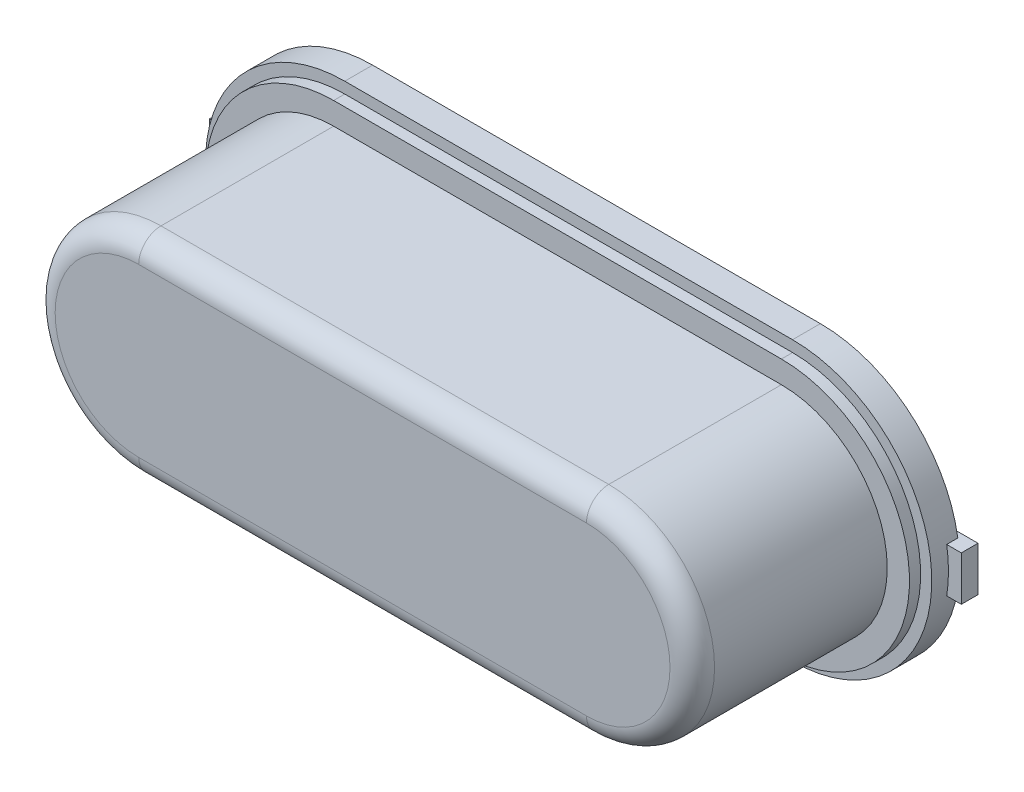
ISO-10303-21;
HEADER;
FILE_DESCRIPTION(('STEP AP214'),'2;1');
FILE_NAME('part.step','',(''),(''),'','','');
FILE_SCHEMA(('AUTOMOTIVE_DESIGN { 1 0 10303 214 1 1 1 1 }'));
ENDSEC;
DATA;
#1=APPLICATION_CONTEXT('core data for automotive mechanical design processes');
#2=APPLICATION_PROTOCOL_DEFINITION('international standard','automotive_design',2000,#1);
#3=PRODUCT_CONTEXT('',#1,'mechanical');
#4=PRODUCT('Part','Part','',(#3));
#5=PRODUCT_RELATED_PRODUCT_CATEGORY('part','',(#4));
#6=PRODUCT_DEFINITION_FORMATION('','',#4);
#7=PRODUCT_DEFINITION_CONTEXT('part definition',#1,'design');
#8=PRODUCT_DEFINITION('design','',#6,#7);
#9=PRODUCT_DEFINITION_SHAPE('','',#8);
#10=(LENGTH_UNIT() NAMED_UNIT(*) SI_UNIT(.MILLI.,.METRE.));
#11=(NAMED_UNIT(*) PLANE_ANGLE_UNIT() SI_UNIT($,.RADIAN.));
#12=(NAMED_UNIT(*) SI_UNIT($,.STERADIAN.) SOLID_ANGLE_UNIT());
#13=UNCERTAINTY_MEASURE_WITH_UNIT(LENGTH_MEASURE(1.E-05),#10,'distance_accuracy_value','');
#14=(GEOMETRIC_REPRESENTATION_CONTEXT(3) GLOBAL_UNCERTAINTY_ASSIGNED_CONTEXT((#13)) GLOBAL_UNIT_ASSIGNED_CONTEXT((#10,
#11,#12)) REPRESENTATION_CONTEXT('',''));
#15=CARTESIAN_POINT('',(0.,0.,0.));
#16=DIRECTION('',(0.,0.,1.));
#17=DIRECTION('',(1.,0.,0.));
#18=AXIS2_PLACEMENT_3D('',#15,#16,#17);
#19=CARTESIAN_POINT('',(0.,0.,0.1));
#20=DIRECTION('',(0.,0.,1.));
#21=DIRECTION('',(1.,0.,0.));
#22=AXIS2_PLACEMENT_3D('',#19,#20,#21);
#23=PLANE('',#22);
#24=DIRECTION('',(-1.,0.,0.));
#25=VECTOR('',#24,1.);
#26=CARTESIAN_POINT('',(0.,-0.4,0.1));
#27=LINE('',#26,#25);
#28=CARTESIAN_POINT('',(6.48774720177993,-0.399999999999998,0.1));
#29=VERTEX_POINT('',#28);
#30=CARTESIAN_POINT('',(2.2,-0.399999999999999,0.1));
#31=VERTEX_POINT('',#30);
#32=EDGE_CURVE('E250',#29,#31,#27,.T.);
#33=ORIENTED_EDGE('',*,*,#32,.F.);
#34=CARTESIAN_POINT('',(4.01995466592931,0.,0.1));
#35=DIRECTION('',(0.,0.,1.));
#36=DIRECTION('',(1.,0.,0.));
#37=AXIS2_PLACEMENT_3D('',#34,#35,#36);
#38=CIRCLE('',#37,2.5);
#39=CARTESIAN_POINT('',(4.01995466592932,-2.5,0.1));
#40=VERTEX_POINT('',#39);
#41=EDGE_CURVE('E290',#40,#29,#38,.T.);
#42=ORIENTED_EDGE('',*,*,#41,.F.);
#43=DIRECTION('',(1.,0.,0.));
#44=VECTOR('',#43,1.);
#45=CARTESIAN_POINT('',(-4.01995466592931,-2.5,0.1));
#46=LINE('',#45,#44);
#47=CARTESIAN_POINT('',(-4.01995466592931,-2.5,0.100000000000002));
#48=VERTEX_POINT('',#47);
#49=EDGE_CURVE('E286',#48,#40,#46,.T.);
#50=ORIENTED_EDGE('',*,*,#49,.F.);
#51=CARTESIAN_POINT('',(-4.01995466592931,0.,0.1));
#52=DIRECTION('',(0.,0.,1.));
#53=DIRECTION('',(1.,0.,0.));
#54=AXIS2_PLACEMENT_3D('',#51,#52,#53);
#55=CIRCLE('',#54,2.5);
#56=CARTESIAN_POINT('',(-6.48774720177993,-0.4,0.1));
#57=VERTEX_POINT('',#56);
#58=EDGE_CURVE('E393',#57,#48,#55,.T.);
#59=ORIENTED_EDGE('',*,*,#58,.F.);
#60=DIRECTION('',(-1.,0.,0.));
#61=VECTOR('',#60,1.);
#62=CARTESIAN_POINT('',(0.,-0.4,0.1));
#63=LINE('',#62,#61);
#64=CARTESIAN_POINT('',(-2.2,-0.4,0.1));
#65=VERTEX_POINT('',#64);
#66=EDGE_CURVE('E403',#65,#57,#63,.T.);
#67=ORIENTED_EDGE('',*,*,#66,.F.);
#68=DIRECTION('',(0.,-1.,0.));
#69=VECTOR('',#68,1.);
#70=CARTESIAN_POINT('',(-2.2,0.,0.1));
#71=LINE('',#70,#69);
#72=CARTESIAN_POINT('',(-2.2,0.4,0.1));
#73=VERTEX_POINT('',#72);
#74=EDGE_CURVE('E400',#73,#65,#71,.T.);
#75=ORIENTED_EDGE('',*,*,#74,.F.);
#76=DIRECTION('',(1.,0.,0.));
#77=VECTOR('',#76,1.);
#78=CARTESIAN_POINT('',(0.,0.4,0.1));
#79=LINE('',#78,#77);
#80=CARTESIAN_POINT('',(-6.48774720177993,0.4,0.1));
#81=VERTEX_POINT('',#80);
#82=EDGE_CURVE('E397',#81,#73,#79,.T.);
#83=ORIENTED_EDGE('',*,*,#82,.F.);
#84=CARTESIAN_POINT('',(-4.01995466592931,2.5,0.1));
#85=VERTEX_POINT('',#84);
#86=EDGE_CURVE('E394',#85,#81,#55,.T.);
#87=ORIENTED_EDGE('',*,*,#86,.F.);
#88=DIRECTION('',(-1.,0.,0.));
#89=VECTOR('',#88,1.);
#90=CARTESIAN_POINT('',(-4.01995466592931,2.5,0.1));
#91=LINE('',#90,#89);
#92=CARTESIAN_POINT('',(4.01995466592931,2.5,0.1));
#93=VERTEX_POINT('',#92);
#94=EDGE_CURVE('E293',#93,#85,#91,.T.);
#95=ORIENTED_EDGE('',*,*,#94,.F.);
#96=CARTESIAN_POINT('',(6.48774720177993,0.400000000000002,0.1));
#97=VERTEX_POINT('',#96);
#98=EDGE_CURVE('E289',#97,#93,#38,.T.);
#99=ORIENTED_EDGE('',*,*,#98,.F.);
#100=DIRECTION('',(1.,0.,0.));
#101=VECTOR('',#100,1.);
#102=CARTESIAN_POINT('',(0.,0.4,0.1));
#103=LINE('',#102,#101);
#104=CARTESIAN_POINT('',(2.2,0.400000000000001,0.1));
#105=VERTEX_POINT('',#104);
#106=EDGE_CURVE('E248',#105,#97,#103,.T.);
#107=ORIENTED_EDGE('',*,*,#106,.F.);
#108=DIRECTION('',(0.,1.,0.));
#109=VECTOR('',#108,1.);
#110=CARTESIAN_POINT('',(2.2,0.,0.1));
#111=LINE('',#110,#109);
#112=EDGE_CURVE('E12',#31,#105,#111,.T.);
#113=ORIENTED_EDGE('',*,*,#112,.F.);
#114=EDGE_LOOP('',(#33,#42,#50,#59,#67,#75,#83,#87,#95,#99,#107,#113));
#115=FACE_BOUND('',#114,.T.);
#116=ADVANCED_FACE('F39',(#115),#23,.F.);
#117=CARTESIAN_POINT('',(4.01995466592931,0.,4.3));
#118=DIRECTION('',(0.,0.,-1.));
#119=DIRECTION('',(-1.,0.,0.));
#120=AXIS2_PLACEMENT_3D('',#117,#118,#119);
#121=CYLINDRICAL_SURFACE('',#120,2.5);
#122=DIRECTION('',(0.,0.,-1.));
#123=VECTOR('',#122,1.);
#124=CARTESIAN_POINT('',(6.48774720177993,-0.399999999999998,4.3));
#125=LINE('',#124,#123);
#126=CARTESIAN_POINT('',(6.48774720177993,-0.399999999999998,0.3));
#127=VERTEX_POINT('',#126);
#128=EDGE_CURVE('E47',#127,#29,#125,.T.);
#129=ORIENTED_EDGE('',*,*,#128,.F.);
#130=CARTESIAN_POINT('',(4.01995466592931,0.,0.3));
#131=DIRECTION('',(0.,0.,1.));
#132=DIRECTION('',(1.,0.,0.));
#133=AXIS2_PLACEMENT_3D('',#130,#131,#132);
#134=CIRCLE('',#133,2.5);
#135=CARTESIAN_POINT('',(6.48774720177993,0.400000000000002,0.3));
#136=VERTEX_POINT('',#135);
#137=EDGE_CURVE('E216',#127,#136,#134,.T.);
#138=ORIENTED_EDGE('',*,*,#137,.T.);
#139=DIRECTION('',(0.,0.,-1.));
#140=VECTOR('',#139,1.);
#141=CARTESIAN_POINT('',(6.48774720177993,0.400000000000002,4.3));
#142=LINE('',#141,#140);
#143=EDGE_CURVE('E408',#97,#136,#142,.F.);
#144=ORIENTED_EDGE('',*,*,#143,.F.);
#145=ORIENTED_EDGE('',*,*,#98,.T.);
#146=DIRECTION('',(0.,0.,-1.));
#147=VECTOR('',#146,1.);
#148=CARTESIAN_POINT('',(4.01995466592931,2.5,4.3));
#149=LINE('',#148,#147);
#150=CARTESIAN_POINT('',(4.01995466592931,2.5,0.600000000000001));
#151=VERTEX_POINT('',#150);
#152=EDGE_CURVE('E347',#151,#93,#149,.T.);
#153=ORIENTED_EDGE('',*,*,#152,.F.);
#154=CARTESIAN_POINT('',(4.01995466592931,0.,0.6));
#155=DIRECTION('',(0.,0.,1.));
#156=DIRECTION('',(1.,0.,0.));
#157=AXIS2_PLACEMENT_3D('',#154,#155,#156);
#158=CIRCLE('',#157,2.5);
#159=CARTESIAN_POINT('',(4.01995466592932,-2.5,0.6));
#160=VERTEX_POINT('',#159);
#161=EDGE_CURVE('E316',#160,#151,#158,.T.);
#162=ORIENTED_EDGE('',*,*,#161,.F.);
#163=DIRECTION('',(0.,0.,-1.));
#164=VECTOR('',#163,1.);
#165=CARTESIAN_POINT('',(4.01995466592932,-2.5,4.3));
#166=LINE('',#165,#164);
#167=EDGE_CURVE('E350',#160,#40,#166,.T.);
#168=ORIENTED_EDGE('',*,*,#167,.T.);
#169=ORIENTED_EDGE('',*,*,#41,.T.);
#170=EDGE_LOOP('',(#129,#138,#144,#145,#153,#162,#168,#169));
#171=FACE_BOUND('',#170,.T.);
#172=ADVANCED_FACE('F416',(#171),#121,.T.);
#173=CARTESIAN_POINT('',(-4.01995466592931,0.,4.3));
#174=DIRECTION('',(0.,0.,-1.));
#175=DIRECTION('',(-1.,0.,0.));
#176=AXIS2_PLACEMENT_3D('',#173,#174,#175);
#177=CYLINDRICAL_SURFACE('',#176,2.5);
#178=DIRECTION('',(0.,0.,-1.));
#179=VECTOR('',#178,1.);
#180=CARTESIAN_POINT('',(-6.48774720177993,-0.4,4.3));
#181=LINE('',#180,#179);
#182=CARTESIAN_POINT('',(-6.48774720177993,-0.4,0.3));
#183=VERTEX_POINT('',#182);
#184=EDGE_CURVE('E284',#57,#183,#181,.F.);
#185=ORIENTED_EDGE('',*,*,#184,.F.);
#186=ORIENTED_EDGE('',*,*,#58,.T.);
#187=DIRECTION('',(0.,0.,-1.));
#188=VECTOR('',#187,1.);
#189=CARTESIAN_POINT('',(-4.01995466592931,-2.5,4.3));
#190=LINE('',#189,#188);
#191=CARTESIAN_POINT('',(-4.01995466592931,-2.5,0.6));
#192=VERTEX_POINT('',#191);
#193=EDGE_CURVE('E353',#192,#48,#190,.T.);
#194=ORIENTED_EDGE('',*,*,#193,.F.);
#195=CARTESIAN_POINT('',(-4.01995466592931,0.,0.6));
#196=DIRECTION('',(0.,0.,1.));
#197=DIRECTION('',(1.,0.,0.));
#198=AXIS2_PLACEMENT_3D('',#195,#196,#197);
#199=CIRCLE('',#198,2.5);
#200=CARTESIAN_POINT('',(-4.01995466592931,2.5,0.6));
#201=VERTEX_POINT('',#200);
#202=EDGE_CURVE('E320',#201,#192,#199,.T.);
#203=ORIENTED_EDGE('',*,*,#202,.F.);
#204=DIRECTION('',(0.,0.,-1.));
#205=VECTOR('',#204,1.);
#206=CARTESIAN_POINT('',(-4.01995466592931,2.5,4.3));
#207=LINE('',#206,#205);
#208=EDGE_CURVE('E344',#201,#85,#207,.T.);
#209=ORIENTED_EDGE('',*,*,#208,.T.);
#210=ORIENTED_EDGE('',*,*,#86,.T.);
#211=DIRECTION('',(0.,0.,-1.));
#212=VECTOR('',#211,1.);
#213=CARTESIAN_POINT('',(-6.48774720177993,0.4,4.3));
#214=LINE('',#213,#212);
#215=CARTESIAN_POINT('',(-6.48774720177993,0.4,0.3));
#216=VERTEX_POINT('',#215);
#217=EDGE_CURVE('E281',#216,#81,#214,.T.);
#218=ORIENTED_EDGE('',*,*,#217,.F.);
#219=CARTESIAN_POINT('',(-4.01995466592931,0.,0.3));
#220=DIRECTION('',(0.,0.,1.));
#221=DIRECTION('',(1.,0.,0.));
#222=AXIS2_PLACEMENT_3D('',#219,#220,#221);
#223=CIRCLE('',#222,2.5);
#224=EDGE_CURVE('E62',#216,#183,#223,.T.);
#225=ORIENTED_EDGE('',*,*,#224,.T.);
#226=EDGE_LOOP('',(#185,#186,#194,#203,#209,#210,#218,#225));
#227=FACE_BOUND('',#226,.T.);
#228=ADVANCED_FACE('F437',(#227),#177,.T.);
#229=CARTESIAN_POINT('',(0.,0.,0.8));
#230=DIRECTION('',(0.,0.,1.));
#231=DIRECTION('',(1.,0.,0.));
#232=AXIS2_PLACEMENT_3D('',#229,#230,#231);
#233=PLANE('',#232);
#234=CARTESIAN_POINT('',(-4.01995466592931,0.,0.8));
#235=DIRECTION('',(0.,0.,1.));
#236=DIRECTION('',(1.,0.,0.));
#237=AXIS2_PLACEMENT_3D('',#234,#235,#236);
#238=CIRCLE('',#237,2.3);
#239=CARTESIAN_POINT('',(-4.01995466592931,-2.3,0.8));
#240=VERTEX_POINT('',#239);
#241=CARTESIAN_POINT('',(-4.01995466592931,2.3,0.8));
#242=VERTEX_POINT('',#241);
#243=EDGE_CURVE('E388',#240,#242,#238,.F.);
#244=ORIENTED_EDGE('',*,*,#243,.F.);
#245=DIRECTION('',(-1.,0.,0.));
#246=VECTOR('',#245,1.);
#247=CARTESIAN_POINT('',(0.,-2.3,0.8));
#248=LINE('',#247,#246);
#249=CARTESIAN_POINT('',(4.01995466592931,-2.3,0.8));
#250=VERTEX_POINT('',#249);
#251=EDGE_CURVE('E386',#250,#240,#248,.T.);
#252=ORIENTED_EDGE('',*,*,#251,.F.);
#253=CARTESIAN_POINT('',(4.01995466592931,0.,0.8));
#254=DIRECTION('',(0.,0.,1.));
#255=DIRECTION('',(1.,0.,0.));
#256=AXIS2_PLACEMENT_3D('',#253,#254,#255);
#257=CIRCLE('',#256,2.3);
#258=CARTESIAN_POINT('',(4.01995466592931,2.3,0.8));
#259=VERTEX_POINT('',#258);
#260=EDGE_CURVE('E384',#259,#250,#257,.F.);
#261=ORIENTED_EDGE('',*,*,#260,.F.);
#262=DIRECTION('',(1.,0.,0.));
#263=VECTOR('',#262,1.);
#264=CARTESIAN_POINT('',(0.,2.3,0.8));
#265=LINE('',#264,#263);
#266=EDGE_CURVE('E374',#242,#259,#265,.T.);
#267=ORIENTED_EDGE('',*,*,#266,.F.);
#268=EDGE_LOOP('',(#244,#252,#261,#267));
#269=FACE_BOUND('',#268,.T.);
#270=CARTESIAN_POINT('',(-4.01995466592931,0.,0.8));
#271=DIRECTION('',(0.,0.,1.));
#272=DIRECTION('',(1.,0.,0.));
#273=AXIS2_PLACEMENT_3D('',#270,#271,#272);
#274=CIRCLE('',#273,1.9);
#275=CARTESIAN_POINT('',(-4.01995466592931,1.9,0.8));
#276=VERTEX_POINT('',#275);
#277=CARTESIAN_POINT('',(-4.01995466592931,-1.9,0.8));
#278=VERTEX_POINT('',#277);
#279=EDGE_CURVE('E323',#276,#278,#274,.T.);
#280=ORIENTED_EDGE('',*,*,#279,.F.);
#281=DIRECTION('',(-1.,0.,0.));
#282=VECTOR('',#281,1.);
#283=CARTESIAN_POINT('',(-4.01995466592931,1.9,0.8));
#284=LINE('',#283,#282);
#285=CARTESIAN_POINT('',(4.01995466592931,1.9,0.8));
#286=VERTEX_POINT('',#285);
#287=EDGE_CURVE('E333',#286,#276,#284,.T.);
#288=ORIENTED_EDGE('',*,*,#287,.F.);
#289=CARTESIAN_POINT('',(4.01995466592931,0.,0.8));
#290=DIRECTION('',(0.,0.,1.));
#291=DIRECTION('',(1.,0.,0.));
#292=AXIS2_PLACEMENT_3D('',#289,#290,#291);
#293=CIRCLE('',#292,1.9);
#294=CARTESIAN_POINT('',(4.01995466592931,-1.9,0.8));
#295=VERTEX_POINT('',#294);
#296=EDGE_CURVE('E330',#295,#286,#293,.T.);
#297=ORIENTED_EDGE('',*,*,#296,.F.);
#298=DIRECTION('',(1.,0.,0.));
#299=VECTOR('',#298,1.);
#300=CARTESIAN_POINT('',(-4.01995466592931,-1.9,0.8));
#301=LINE('',#300,#299);
#302=EDGE_CURVE('E326',#278,#295,#301,.T.);
#303=ORIENTED_EDGE('',*,*,#302,.F.);
#304=EDGE_LOOP('',(#280,#288,#297,#303));
#305=FACE_BOUND('',#304,.T.);
#306=ADVANCED_FACE('F505',(#269,#305),#233,.T.);
#307=CARTESIAN_POINT('',(-4.01995466592931,0.,4.3));
#308=DIRECTION('',(0.,0.,-1.));
#309=DIRECTION('',(-1.,0.,0.));
#310=AXIS2_PLACEMENT_3D('',#307,#308,#309);
#311=CYLINDRICAL_SURFACE('',#310,1.9);
#312=DIRECTION('',(0.,0.,-1.));
#313=VECTOR('',#312,1.);
#314=CARTESIAN_POINT('',(-4.01995466592931,-1.9,4.3));
#315=LINE('',#314,#313);
#316=CARTESIAN_POINT('',(-4.01995466592931,-1.9,3.9));
#317=VERTEX_POINT('',#316);
#318=EDGE_CURVE('E342',#317,#278,#315,.T.);
#319=ORIENTED_EDGE('',*,*,#318,.F.);
#320=CARTESIAN_POINT('',(-4.01995466592931,0.,3.9));
#321=DIRECTION('',(0.,0.,1.));
#322=DIRECTION('',(1.,0.,0.));
#323=AXIS2_PLACEMENT_3D('',#320,#321,#322);
#324=CIRCLE('',#323,1.9);
#325=CARTESIAN_POINT('',(-4.01995466592931,1.9,3.9));
#326=VERTEX_POINT('',#325);
#327=EDGE_CURVE('E372',#317,#326,#324,.F.);
#328=ORIENTED_EDGE('',*,*,#327,.T.);
#329=DIRECTION('',(0.,0.,-1.));
#330=VECTOR('',#329,1.);
#331=CARTESIAN_POINT('',(-4.01995466592931,1.9,4.3));
#332=LINE('',#331,#330);
#333=EDGE_CURVE('E336',#326,#276,#332,.T.);
#334=ORIENTED_EDGE('',*,*,#333,.T.);
#335=ORIENTED_EDGE('',*,*,#279,.T.);
#336=EDGE_LOOP('',(#319,#328,#334,#335));
#337=FACE_BOUND('',#336,.T.);
#338=ADVANCED_FACE('F501',(#337),#311,.T.);
#339=CARTESIAN_POINT('',(-4.01995466592931,-1.9,4.3));
#340=DIRECTION('',(0.,1.,0.));
#341=DIRECTION('',(-1.,0.,0.));
#342=AXIS2_PLACEMENT_3D('',#339,#340,#341);
#343=PLANE('',#342);
#344=DIRECTION('',(0.,0.,-1.));
#345=VECTOR('',#344,1.);
#346=CARTESIAN_POINT('',(4.01995466592931,-1.9,4.3));
#347=LINE('',#346,#345);
#348=CARTESIAN_POINT('',(4.01995466592931,-1.9,3.9));
#349=VERTEX_POINT('',#348);
#350=EDGE_CURVE('E340',#349,#295,#347,.T.);
#351=ORIENTED_EDGE('',*,*,#350,.F.);
#352=DIRECTION('',(1.,0.,0.));
#353=VECTOR('',#352,1.);
#354=CARTESIAN_POINT('',(-4.01995466592931,-1.9,3.9));
#355=LINE('',#354,#353);
#356=EDGE_CURVE('E370',#349,#317,#355,.F.);
#357=ORIENTED_EDGE('',*,*,#356,.T.);
#358=ORIENTED_EDGE('',*,*,#318,.T.);
#359=ORIENTED_EDGE('',*,*,#302,.T.);
#360=EDGE_LOOP('',(#351,#357,#358,#359));
#361=FACE_BOUND('',#360,.T.);
#362=ADVANCED_FACE('F497',(#361),#343,.F.);
#363=CARTESIAN_POINT('',(4.01995466592931,0.,4.3));
#364=DIRECTION('',(0.,0.,-1.));
#365=DIRECTION('',(-1.,0.,0.));
#366=AXIS2_PLACEMENT_3D('',#363,#364,#365);
#367=CYLINDRICAL_SURFACE('',#366,1.9);
#368=DIRECTION('',(0.,0.,-1.));
#369=VECTOR('',#368,1.);
#370=CARTESIAN_POINT('',(4.01995466592931,1.9,4.3));
#371=LINE('',#370,#369);
#372=CARTESIAN_POINT('',(4.01995466592931,1.9,3.9));
#373=VERTEX_POINT('',#372);
#374=EDGE_CURVE('E338',#373,#286,#371,.T.);
#375=ORIENTED_EDGE('',*,*,#374,.F.);
#376=CARTESIAN_POINT('',(4.01995466592931,0.,3.9));
#377=DIRECTION('',(0.,0.,1.));
#378=DIRECTION('',(1.,0.,0.));
#379=AXIS2_PLACEMENT_3D('',#376,#377,#378);
#380=CIRCLE('',#379,1.9);
#381=EDGE_CURVE('E368',#373,#349,#380,.F.);
#382=ORIENTED_EDGE('',*,*,#381,.T.);
#383=ORIENTED_EDGE('',*,*,#350,.T.);
#384=ORIENTED_EDGE('',*,*,#296,.T.);
#385=EDGE_LOOP('',(#375,#382,#383,#384));
#386=FACE_BOUND('',#385,.T.);
#387=ADVANCED_FACE('F493',(#386),#367,.T.);
#388=CARTESIAN_POINT('',(-4.01995466592931,1.9,4.3));
#389=DIRECTION('',(0.,-1.,0.));
#390=DIRECTION('',(1.,0.,0.));
#391=AXIS2_PLACEMENT_3D('',#388,#389,#390);
#392=PLANE('',#391);
#393=ORIENTED_EDGE('',*,*,#333,.F.);
#394=DIRECTION('',(-1.,0.,0.));
#395=VECTOR('',#394,1.);
#396=CARTESIAN_POINT('',(4.01995466592931,1.9,3.9));
#397=LINE('',#396,#395);
#398=EDGE_CURVE('E365',#326,#373,#397,.F.);
#399=ORIENTED_EDGE('',*,*,#398,.T.);
#400=ORIENTED_EDGE('',*,*,#374,.T.);
#401=ORIENTED_EDGE('',*,*,#287,.T.);
#402=EDGE_LOOP('',(#393,#399,#400,#401));
#403=FACE_BOUND('',#402,.T.);
#404=ADVANCED_FACE('F489',(#403),#392,.F.);
#405=CARTESIAN_POINT('',(-4.01995466592931,0.,4.3));
#406=DIRECTION('',(0.,0.,1.));
#407=DIRECTION('',(1.,0.,0.));
#408=AXIS2_PLACEMENT_3D('',#405,#406,#407);
#409=PLANE('',#408);
#410=CARTESIAN_POINT('',(4.01995466592931,0.,4.3));
#411=DIRECTION('',(0.,0.,1.));
#412=DIRECTION('',(1.,0.,0.));
#413=AXIS2_PLACEMENT_3D('',#410,#411,#412);
#414=CIRCLE('',#413,1.5);
#415=CARTESIAN_POINT('',(4.01995466592931,-1.5,4.3));
#416=VERTEX_POINT('',#415);
#417=CARTESIAN_POINT('',(4.01995466592931,1.5,4.3));
#418=VERTEX_POINT('',#417);
#419=EDGE_CURVE('E360',#416,#418,#414,.T.);
#420=ORIENTED_EDGE('',*,*,#419,.T.);
#421=DIRECTION('',(-1.,0.,0.));
#422=VECTOR('',#421,1.);
#423=CARTESIAN_POINT('',(-4.01995466592931,1.5,4.3));
#424=LINE('',#423,#422);
#425=CARTESIAN_POINT('',(-4.01995466592931,1.5,4.3));
#426=VERTEX_POINT('',#425);
#427=EDGE_CURVE('E362',#418,#426,#424,.T.);
#428=ORIENTED_EDGE('',*,*,#427,.T.);
#429=CARTESIAN_POINT('',(-4.01995466592931,0.,4.3));
#430=DIRECTION('',(0.,0.,1.));
#431=DIRECTION('',(1.,0.,0.));
#432=AXIS2_PLACEMENT_3D('',#429,#430,#431);
#433=CIRCLE('',#432,1.5);
#434=CARTESIAN_POINT('',(-4.01995466592931,-1.5,4.3));
#435=VERTEX_POINT('',#434);
#436=EDGE_CURVE('E356',#426,#435,#433,.T.);
#437=ORIENTED_EDGE('',*,*,#436,.T.);
#438=DIRECTION('',(1.,0.,0.));
#439=VECTOR('',#438,1.);
#440=CARTESIAN_POINT('',(4.01995466592931,-1.5,4.3));
#441=LINE('',#440,#439);
#442=EDGE_CURVE('E358',#435,#416,#441,.T.);
#443=ORIENTED_EDGE('',*,*,#442,.T.);
#444=EDGE_LOOP('',(#420,#428,#437,#443));
#445=FACE_BOUND('',#444,.T.);
#446=ADVANCED_FACE('F492',(#445),#409,.T.);
#447=CARTESIAN_POINT('',(-4.01995466592931,-1.5,3.9));
#448=DIRECTION('',(-1.,0.,0.));
#449=DIRECTION('',(0.,-1.,0.));
#450=AXIS2_PLACEMENT_3D('',#447,#448,#449);
#451=CYLINDRICAL_SURFACE('',#450,0.4);
#452=CARTESIAN_POINT('',(-4.01995466592931,-1.5,3.9));
#453=DIRECTION('',(-1.,0.,0.));
#454=DIRECTION('',(0.,0.,1.));
#455=AXIS2_PLACEMENT_3D('',#452,#453,#454);
#456=CIRCLE('',#455,0.4);
#457=EDGE_CURVE('E378',#317,#435,#456,.T.);
#458=ORIENTED_EDGE('',*,*,#457,.F.);
#459=ORIENTED_EDGE('',*,*,#356,.F.);
#460=CARTESIAN_POINT('',(4.01995466592931,-1.5,3.9));
#461=DIRECTION('',(1.,0.,0.));
#462=DIRECTION('',(0.,0.,-1.));
#463=AXIS2_PLACEMENT_3D('',#460,#461,#462);
#464=CIRCLE('',#463,0.4);
#465=EDGE_CURVE('E327',#416,#349,#464,.T.);
#466=ORIENTED_EDGE('',*,*,#465,.F.);
#467=ORIENTED_EDGE('',*,*,#442,.F.);
#468=EDGE_LOOP('',(#458,#459,#466,#467));
#469=FACE_BOUND('',#468,.T.);
#470=ADVANCED_FACE('F41',(#469),#451,.T.);
#471=CARTESIAN_POINT('',(4.01995466592931,0.,3.9));
#472=DIRECTION('',(0.,0.,1.));
#473=DIRECTION('',(1.,0.,0.));
#474=AXIS2_PLACEMENT_3D('',#471,#472,#473);
#475=TOROIDAL_SURFACE('',#474,1.5,0.4);
#476=ORIENTED_EDGE('',*,*,#465,.T.);
#477=ORIENTED_EDGE('',*,*,#381,.F.);
#478=CARTESIAN_POINT('',(4.01995466592931,1.5,3.9));
#479=DIRECTION('',(-1.,0.,0.));
#480=DIRECTION('',(0.,0.,1.));
#481=AXIS2_PLACEMENT_3D('',#478,#479,#480);
#482=CIRCLE('',#481,0.4);
#483=EDGE_CURVE('E376',#418,#373,#482,.T.);
#484=ORIENTED_EDGE('',*,*,#483,.F.);
#485=ORIENTED_EDGE('',*,*,#419,.F.);
#486=EDGE_LOOP('',(#476,#477,#484,#485));
#487=FACE_BOUND('',#486,.T.);
#488=ADVANCED_FACE('F525',(#487),#475,.T.);
#489=CARTESIAN_POINT('',(-4.01995466592931,0.,3.9));
#490=DIRECTION('',(0.,0.,1.));
#491=DIRECTION('',(1.,0.,0.));
#492=AXIS2_PLACEMENT_3D('',#489,#490,#491);
#493=TOROIDAL_SURFACE('',#492,1.5,0.4);
#494=ORIENTED_EDGE('',*,*,#457,.T.);
#495=ORIENTED_EDGE('',*,*,#436,.F.);
#496=CARTESIAN_POINT('',(-4.01995466592931,1.5,3.9));
#497=DIRECTION('',(1.,0.,0.));
#498=DIRECTION('',(0.,0.,-1.));
#499=AXIS2_PLACEMENT_3D('',#496,#497,#498);
#500=CIRCLE('',#499,0.4);
#501=EDGE_CURVE('E322',#326,#426,#500,.T.);
#502=ORIENTED_EDGE('',*,*,#501,.F.);
#503=ORIENTED_EDGE('',*,*,#327,.F.);
#504=EDGE_LOOP('',(#494,#495,#502,#503));
#505=FACE_BOUND('',#504,.T.);
#506=ADVANCED_FACE('F522',(#505),#493,.T.);
#507=CARTESIAN_POINT('',(-4.01995466592931,1.5,3.9));
#508=DIRECTION('',(1.,0.,0.));
#509=DIRECTION('',(0.,1.,0.));
#510=AXIS2_PLACEMENT_3D('',#507,#508,#509);
#511=CYLINDRICAL_SURFACE('',#510,0.4);
#512=ORIENTED_EDGE('',*,*,#483,.T.);
#513=ORIENTED_EDGE('',*,*,#398,.F.);
#514=ORIENTED_EDGE('',*,*,#501,.T.);
#515=ORIENTED_EDGE('',*,*,#427,.F.);
#516=EDGE_LOOP('',(#512,#513,#514,#515));
#517=FACE_BOUND('',#516,.T.);
#518=ADVANCED_FACE('F487',(#517),#511,.T.);
#519=CARTESIAN_POINT('',(0.,0.,0.6));
#520=DIRECTION('',(0.,0.,1.));
#521=DIRECTION('',(1.,0.,0.));
#522=AXIS2_PLACEMENT_3D('',#519,#520,#521);
#523=PLANE('',#522);
#524=CARTESIAN_POINT('',(-4.01995466592931,0.,0.6));
#525=DIRECTION('',(0.,0.,1.));
#526=DIRECTION('',(1.,0.,0.));
#527=AXIS2_PLACEMENT_3D('',#524,#525,#526);
#528=CIRCLE('',#527,2.3);
#529=CARTESIAN_POINT('',(-4.01995466592931,2.3,0.6));
#530=VERTEX_POINT('',#529);
#531=CARTESIAN_POINT('',(-4.01995466592931,-2.3,0.6));
#532=VERTEX_POINT('',#531);
#533=EDGE_CURVE('E296',#530,#532,#528,.T.);
#534=ORIENTED_EDGE('',*,*,#533,.F.);
#535=DIRECTION('',(-1.,0.,0.));
#536=VECTOR('',#535,1.);
#537=CARTESIAN_POINT('',(-4.01995466592931,2.3,0.6));
#538=LINE('',#537,#536);
#539=CARTESIAN_POINT('',(4.01995466592931,2.3,0.6));
#540=VERTEX_POINT('',#539);
#541=EDGE_CURVE('E305',#540,#530,#538,.T.);
#542=ORIENTED_EDGE('',*,*,#541,.F.);
#543=CARTESIAN_POINT('',(4.01995466592931,0.,0.6));
#544=DIRECTION('',(0.,0.,1.));
#545=DIRECTION('',(1.,0.,0.));
#546=AXIS2_PLACEMENT_3D('',#543,#544,#545);
#547=CIRCLE('',#546,2.3);
#548=CARTESIAN_POINT('',(4.01995466592931,-2.3,0.6));
#549=VERTEX_POINT('',#548);
#550=EDGE_CURVE('E302',#549,#540,#547,.T.);
#551=ORIENTED_EDGE('',*,*,#550,.F.);
#552=DIRECTION('',(1.,0.,0.));
#553=VECTOR('',#552,1.);
#554=CARTESIAN_POINT('',(-4.01995466592931,-2.3,0.6));
#555=LINE('',#554,#553);
#556=EDGE_CURVE('E299',#532,#549,#555,.T.);
#557=ORIENTED_EDGE('',*,*,#556,.F.);
#558=EDGE_LOOP('',(#534,#542,#551,#557));
#559=FACE_BOUND('',#558,.T.);
#560=ORIENTED_EDGE('',*,*,#202,.T.);
#561=DIRECTION('',(1.,0.,0.));
#562=VECTOR('',#561,1.);
#563=CARTESIAN_POINT('',(-4.01995466592931,-2.5,0.6));
#564=LINE('',#563,#562);
#565=EDGE_CURVE('E318',#192,#160,#564,.T.);
#566=ORIENTED_EDGE('',*,*,#565,.T.);
#567=ORIENTED_EDGE('',*,*,#161,.T.);
#568=DIRECTION('',(-1.,0.,0.));
#569=VECTOR('',#568,1.);
#570=CARTESIAN_POINT('',(-4.01995466592931,2.5,0.6));
#571=LINE('',#570,#569);
#572=EDGE_CURVE('E391',#151,#201,#571,.T.);
#573=ORIENTED_EDGE('',*,*,#572,.T.);
#574=EDGE_LOOP('',(#560,#566,#567,#573));
#575=FACE_BOUND('',#574,.T.);
#576=ADVANCED_FACE('F483',(#559,#575),#523,.T.);
#577=CARTESIAN_POINT('',(-4.01995466592931,0.,4.3));
#578=DIRECTION('',(0.,0.,-1.));
#579=DIRECTION('',(-1.,0.,0.));
#580=AXIS2_PLACEMENT_3D('',#577,#578,#579);
#581=CYLINDRICAL_SURFACE('',#580,2.3);
#582=ORIENTED_EDGE('',*,*,#243,.T.);
#583=DIRECTION('',(0.,0.,-1.));
#584=VECTOR('',#583,1.);
#585=CARTESIAN_POINT('',(-4.01995466592931,2.3,4.3));
#586=LINE('',#585,#584);
#587=EDGE_CURVE('E308',#242,#530,#586,.T.);
#588=ORIENTED_EDGE('',*,*,#587,.T.);
#589=ORIENTED_EDGE('',*,*,#533,.T.);
#590=DIRECTION('',(0.,0.,-1.));
#591=VECTOR('',#590,1.);
#592=CARTESIAN_POINT('',(-4.01995466592931,-2.3,4.3));
#593=LINE('',#592,#591);
#594=EDGE_CURVE('E314',#240,#532,#593,.T.);
#595=ORIENTED_EDGE('',*,*,#594,.F.);
#596=EDGE_LOOP('',(#582,#588,#589,#595));
#597=FACE_BOUND('',#596,.T.);
#598=ADVANCED_FACE('F479',(#597),#581,.T.);
#599=CARTESIAN_POINT('',(-4.01995466592931,-2.3,4.3));
#600=DIRECTION('',(0.,1.,0.));
#601=DIRECTION('',(-1.,0.,0.));
#602=AXIS2_PLACEMENT_3D('',#599,#600,#601);
#603=PLANE('',#602);
#604=ORIENTED_EDGE('',*,*,#251,.T.);
#605=ORIENTED_EDGE('',*,*,#594,.T.);
#606=ORIENTED_EDGE('',*,*,#556,.T.);
#607=DIRECTION('',(0.,0.,-1.));
#608=VECTOR('',#607,1.);
#609=CARTESIAN_POINT('',(4.01995466592931,-2.3,4.3));
#610=LINE('',#609,#608);
#611=EDGE_CURVE('E312',#250,#549,#610,.T.);
#612=ORIENTED_EDGE('',*,*,#611,.F.);
#613=EDGE_LOOP('',(#604,#605,#606,#612));
#614=FACE_BOUND('',#613,.T.);
#615=ADVANCED_FACE('F475',(#614),#603,.F.);
#616=CARTESIAN_POINT('',(4.01995466592931,0.,4.3));
#617=DIRECTION('',(0.,0.,-1.));
#618=DIRECTION('',(-1.,0.,0.));
#619=AXIS2_PLACEMENT_3D('',#616,#617,#618);
#620=CYLINDRICAL_SURFACE('',#619,2.3);
#621=ORIENTED_EDGE('',*,*,#260,.T.);
#622=ORIENTED_EDGE('',*,*,#611,.T.);
#623=ORIENTED_EDGE('',*,*,#550,.T.);
#624=DIRECTION('',(0.,0.,-1.));
#625=VECTOR('',#624,1.);
#626=CARTESIAN_POINT('',(4.01995466592931,2.3,4.3));
#627=LINE('',#626,#625);
#628=EDGE_CURVE('E310',#259,#540,#627,.T.);
#629=ORIENTED_EDGE('',*,*,#628,.F.);
#630=EDGE_LOOP('',(#621,#622,#623,#629));
#631=FACE_BOUND('',#630,.T.);
#632=ADVANCED_FACE('F471',(#631),#620,.T.);
#633=CARTESIAN_POINT('',(-4.01995466592931,2.3,4.3));
#634=DIRECTION('',(0.,-1.,0.));
#635=DIRECTION('',(1.,0.,0.));
#636=AXIS2_PLACEMENT_3D('',#633,#634,#635);
#637=PLANE('',#636);
#638=ORIENTED_EDGE('',*,*,#266,.T.);
#639=ORIENTED_EDGE('',*,*,#628,.T.);
#640=ORIENTED_EDGE('',*,*,#541,.T.);
#641=ORIENTED_EDGE('',*,*,#587,.F.);
#642=EDGE_LOOP('',(#638,#639,#640,#641));
#643=FACE_BOUND('',#642,.T.);
#644=ADVANCED_FACE('F467',(#643),#637,.F.);
#645=CARTESIAN_POINT('',(-4.01995466592931,2.5,4.3));
#646=DIRECTION('',(0.,-1.,0.));
#647=DIRECTION('',(1.,0.,0.));
#648=AXIS2_PLACEMENT_3D('',#645,#646,#647);
#649=PLANE('',#648);
#650=ORIENTED_EDGE('',*,*,#152,.T.);
#651=ORIENTED_EDGE('',*,*,#94,.T.);
#652=ORIENTED_EDGE('',*,*,#208,.F.);
#653=ORIENTED_EDGE('',*,*,#572,.F.);
#654=EDGE_LOOP('',(#650,#651,#652,#653));
#655=FACE_BOUND('',#654,.T.);
#656=ADVANCED_FACE('F470',(#655),#649,.F.);
#657=CARTESIAN_POINT('',(-4.01995466592931,-2.5,4.3));
#658=DIRECTION('',(0.,1.,0.));
#659=DIRECTION('',(-1.,0.,0.));
#660=AXIS2_PLACEMENT_3D('',#657,#658,#659);
#661=PLANE('',#660);
#662=ORIENTED_EDGE('',*,*,#193,.T.);
#663=ORIENTED_EDGE('',*,*,#49,.T.);
#664=ORIENTED_EDGE('',*,*,#167,.F.);
#665=ORIENTED_EDGE('',*,*,#565,.F.);
#666=EDGE_LOOP('',(#662,#663,#664,#665));
#667=FACE_BOUND('',#666,.T.);
#668=ADVANCED_FACE('F422',(#667),#661,.F.);
#669=CARTESIAN_POINT('',(0.,0.,0.3));
#670=DIRECTION('',(0.,0.,1.));
#671=DIRECTION('',(1.,0.,0.));
#672=AXIS2_PLACEMENT_3D('',#669,#670,#671);
#673=PLANE('',#672);
#674=ORIENTED_EDGE('',*,*,#224,.F.);
#675=DIRECTION('',(-1.,0.,0.));
#676=VECTOR('',#675,1.);
#677=CARTESIAN_POINT('',(-6.75,0.4,0.3));
#678=LINE('',#677,#676);
#679=CARTESIAN_POINT('',(-6.75,0.4,0.3));
#680=VERTEX_POINT('',#679);
#681=EDGE_CURVE('E260',#216,#680,#678,.T.);
#682=ORIENTED_EDGE('',*,*,#681,.T.);
#683=DIRECTION('',(0.,-1.,0.));
#684=VECTOR('',#683,1.);
#685=CARTESIAN_POINT('',(-6.75,0.4,0.3));
#686=LINE('',#685,#684);
#687=CARTESIAN_POINT('',(-6.75,-0.4,0.3));
#688=VERTEX_POINT('',#687);
#689=EDGE_CURVE('E253',#680,#688,#686,.T.);
#690=ORIENTED_EDGE('',*,*,#689,.T.);
#691=DIRECTION('',(1.,0.,0.));
#692=VECTOR('',#691,1.);
#693=CARTESIAN_POINT('',(-6.75,-0.4,0.3));
#694=LINE('',#693,#692);
#695=EDGE_CURVE('E256',#688,#183,#694,.T.);
#696=ORIENTED_EDGE('',*,*,#695,.T.);
#697=EDGE_LOOP('',(#674,#682,#690,#696));
#698=FACE_BOUND('',#697,.T.);
#699=ADVANCED_FACE('F439',(#698),#673,.T.);
#700=CARTESIAN_POINT('',(-6.75,-0.4,0.3));
#701=DIRECTION('',(0.,1.,0.));
#702=DIRECTION('',(0.,0.,1.));
#703=AXIS2_PLACEMENT_3D('',#700,#701,#702);
#704=PLANE('',#703);
#705=ORIENTED_EDGE('',*,*,#66,.T.);
#706=ORIENTED_EDGE('',*,*,#184,.T.);
#707=ORIENTED_EDGE('',*,*,#695,.F.);
#708=DIRECTION('',(0.,0.,-1.));
#709=VECTOR('',#708,1.);
#710=CARTESIAN_POINT('',(-6.75,-0.4,0.3));
#711=LINE('',#710,#709);
#712=CARTESIAN_POINT('',(-6.75,-0.4,0.));
#713=VERTEX_POINT('',#712);
#714=EDGE_CURVE('E278',#688,#713,#711,.T.);
#715=ORIENTED_EDGE('',*,*,#714,.T.);
#716=DIRECTION('',(1.,0.,0.));
#717=VECTOR('',#716,1.);
#718=CARTESIAN_POINT('',(-6.75,-0.4,0.));
#719=LINE('',#718,#717);
#720=CARTESIAN_POINT('',(-2.2,-0.4,0.));
#721=VERTEX_POINT('',#720);
#722=EDGE_CURVE('E265',#713,#721,#719,.T.);
#723=ORIENTED_EDGE('',*,*,#722,.T.);
#724=DIRECTION('',(0.,0.,-1.));
#725=VECTOR('',#724,1.);
#726=CARTESIAN_POINT('',(-2.2,-0.4,0.3));
#727=LINE('',#726,#725);
#728=EDGE_CURVE('E276',#65,#721,#727,.T.);
#729=ORIENTED_EDGE('',*,*,#728,.F.);
#730=EDGE_LOOP('',(#705,#706,#707,#715,#723,#729));
#731=FACE_BOUND('',#730,.T.);
#732=ADVANCED_FACE('F427',(#731),#704,.F.);
#733=CARTESIAN_POINT('',(-2.2,0.4,0.3));
#734=DIRECTION('',(-1.,0.,0.));
#735=DIRECTION('',(0.,0.,1.));
#736=AXIS2_PLACEMENT_3D('',#733,#734,#735);
#737=PLANE('',#736);
#738=DIRECTION('',(0.,0.,-1.));
#739=VECTOR('',#738,1.);
#740=CARTESIAN_POINT('',(-2.2,0.4,0.3));
#741=LINE('',#740,#739);
#742=CARTESIAN_POINT('',(-2.2,0.4,0.));
#743=VERTEX_POINT('',#742);
#744=EDGE_CURVE('E274',#73,#743,#741,.T.);
#745=ORIENTED_EDGE('',*,*,#744,.F.);
#746=ORIENTED_EDGE('',*,*,#74,.T.);
#747=ORIENTED_EDGE('',*,*,#728,.T.);
#748=DIRECTION('',(0.,1.,0.));
#749=VECTOR('',#748,1.);
#750=CARTESIAN_POINT('',(-2.2,0.4,0.));
#751=LINE('',#750,#749);
#752=EDGE_CURVE('E268',#721,#743,#751,.T.);
#753=ORIENTED_EDGE('',*,*,#752,.T.);
#754=EDGE_LOOP('',(#745,#746,#747,#753));
#755=FACE_BOUND('',#754,.T.);
#756=ADVANCED_FACE('F431',(#755),#737,.F.);
#757=CARTESIAN_POINT('',(-6.75,0.4,0.3));
#758=DIRECTION('',(0.,-1.,0.));
#759=DIRECTION('',(0.,0.,-1.));
#760=AXIS2_PLACEMENT_3D('',#757,#758,#759);
#761=PLANE('',#760);
#762=ORIENTED_EDGE('',*,*,#681,.F.);
#763=ORIENTED_EDGE('',*,*,#217,.T.);
#764=ORIENTED_EDGE('',*,*,#82,.T.);
#765=ORIENTED_EDGE('',*,*,#744,.T.);
#766=DIRECTION('',(-1.,0.,0.));
#767=VECTOR('',#766,1.);
#768=CARTESIAN_POINT('',(-6.75,0.4,0.));
#769=LINE('',#768,#767);
#770=CARTESIAN_POINT('',(-6.75,0.4,0.));
#771=VERTEX_POINT('',#770);
#772=EDGE_CURVE('E257',#743,#771,#769,.T.);
#773=ORIENTED_EDGE('',*,*,#772,.T.);
#774=DIRECTION('',(0.,0.,-1.));
#775=VECTOR('',#774,1.);
#776=CARTESIAN_POINT('',(-6.75,0.4,0.3));
#777=LINE('',#776,#775);
#778=EDGE_CURVE('E262',#680,#771,#777,.T.);
#779=ORIENTED_EDGE('',*,*,#778,.F.);
#780=EDGE_LOOP('',(#762,#763,#764,#765,#773,#779));
#781=FACE_BOUND('',#780,.T.);
#782=ADVANCED_FACE('F435',(#781),#761,.F.);
#783=CARTESIAN_POINT('',(-6.75,0.4,0.3));
#784=DIRECTION('',(1.,0.,0.));
#785=DIRECTION('',(0.,0.,-1.));
#786=AXIS2_PLACEMENT_3D('',#783,#784,#785);
#787=PLANE('',#786);
#788=DIRECTION('',(0.,-1.,0.));
#789=VECTOR('',#788,1.);
#790=CARTESIAN_POINT('',(-6.75,0.4,0.));
#791=LINE('',#790,#789);
#792=EDGE_CURVE('E252',#771,#713,#791,.T.);
#793=ORIENTED_EDGE('',*,*,#792,.T.);
#794=ORIENTED_EDGE('',*,*,#714,.F.);
#795=ORIENTED_EDGE('',*,*,#689,.F.);
#796=ORIENTED_EDGE('',*,*,#778,.T.);
#797=EDGE_LOOP('',(#793,#794,#795,#796));
#798=FACE_BOUND('',#797,.T.);
#799=ADVANCED_FACE('F444',(#798),#787,.F.);
#800=CARTESIAN_POINT('',(0.,0.,0.));
#801=DIRECTION('',(0.,0.,1.));
#802=DIRECTION('',(1.,0.,0.));
#803=AXIS2_PLACEMENT_3D('',#800,#801,#802);
#804=PLANE('',#803);
#805=ORIENTED_EDGE('',*,*,#792,.F.);
#806=ORIENTED_EDGE('',*,*,#772,.F.);
#807=ORIENTED_EDGE('',*,*,#752,.F.);
#808=ORIENTED_EDGE('',*,*,#722,.F.);
#809=EDGE_LOOP('',(#805,#806,#807,#808));
#810=FACE_BOUND('',#809,.T.);
#811=ADVANCED_FACE('F446',(#810),#804,.F.);
#812=CARTESIAN_POINT('',(2.2,0.400000000000001,0.3));
#813=DIRECTION('',(1.,0.,0.));
#814=DIRECTION('',(0.,0.,-1.));
#815=AXIS2_PLACEMENT_3D('',#812,#813,#814);
#816=PLANE('',#815);
#817=DIRECTION('',(0.,0.,-1.));
#818=VECTOR('',#817,1.);
#819=CARTESIAN_POINT('',(2.2,-0.399999999999999,0.3));
#820=LINE('',#819,#818);
#821=CARTESIAN_POINT('',(2.2,-0.399999999999999,0.));
#822=VERTEX_POINT('',#821);
#823=EDGE_CURVE('E228',#31,#822,#820,.T.);
#824=ORIENTED_EDGE('',*,*,#823,.F.);
#825=ORIENTED_EDGE('',*,*,#112,.T.);
#826=DIRECTION('',(0.,0.,-1.));
#827=VECTOR('',#826,1.);
#828=CARTESIAN_POINT('',(2.2,0.400000000000001,0.3));
#829=LINE('',#828,#827);
#830=CARTESIAN_POINT('',(2.2,0.400000000000001,0.));
#831=VERTEX_POINT('',#830);
#832=EDGE_CURVE('E234',#105,#831,#829,.T.);
#833=ORIENTED_EDGE('',*,*,#832,.T.);
#834=DIRECTION('',(0.,-1.,0.));
#835=VECTOR('',#834,1.);
#836=CARTESIAN_POINT('',(2.2,0.400000000000001,0.));
#837=LINE('',#836,#835);
#838=EDGE_CURVE('E237',#831,#822,#837,.T.);
#839=ORIENTED_EDGE('',*,*,#838,.T.);
#840=EDGE_LOOP('',(#824,#825,#833,#839));
#841=FACE_BOUND('',#840,.T.);
#842=ADVANCED_FACE('F448',(#841),#816,.F.);
#843=CARTESIAN_POINT('',(2.2,-0.399999999999999,0.3));
#844=DIRECTION('',(0.,1.,0.));
#845=DIRECTION('',(-1.,0.,0.));
#846=AXIS2_PLACEMENT_3D('',#843,#844,#845);
#847=PLANE('',#846);
#848=ORIENTED_EDGE('',*,*,#128,.T.);
#849=ORIENTED_EDGE('',*,*,#32,.T.);
#850=ORIENTED_EDGE('',*,*,#823,.T.);
#851=DIRECTION('',(1.,0.,0.));
#852=VECTOR('',#851,1.);
#853=CARTESIAN_POINT('',(2.2,-0.399999999999999,0.));
#854=LINE('',#853,#852);
#855=CARTESIAN_POINT('',(6.75,-0.399999999999998,0.));
#856=VERTEX_POINT('',#855);
#857=EDGE_CURVE('E225',#822,#856,#854,.T.);
#858=ORIENTED_EDGE('',*,*,#857,.T.);
#859=DIRECTION('',(0.,0.,-1.));
#860=VECTOR('',#859,1.);
#861=CARTESIAN_POINT('',(6.75,-0.399999999999998,0.3));
#862=LINE('',#861,#860);
#863=CARTESIAN_POINT('',(6.75,-0.399999999999998,0.3));
#864=VERTEX_POINT('',#863);
#865=EDGE_CURVE('E222',#864,#856,#862,.T.);
#866=ORIENTED_EDGE('',*,*,#865,.F.);
#867=DIRECTION('',(1.,0.,0.));
#868=VECTOR('',#867,1.);
#869=CARTESIAN_POINT('',(2.2,-0.399999999999999,0.3));
#870=LINE('',#869,#868);
#871=EDGE_CURVE('E209',#127,#864,#870,.T.);
#872=ORIENTED_EDGE('',*,*,#871,.F.);
#873=EDGE_LOOP('',(#848,#849,#850,#858,#866,#872));
#874=FACE_BOUND('',#873,.T.);
#875=ADVANCED_FACE('F223',(#874),#847,.F.);
#876=CARTESIAN_POINT('',(2.2,0.400000000000001,0.3));
#877=DIRECTION('',(0.,-1.,0.));
#878=DIRECTION('',(1.,0.,0.));
#879=AXIS2_PLACEMENT_3D('',#876,#877,#878);
#880=PLANE('',#879);
#881=ORIENTED_EDGE('',*,*,#832,.F.);
#882=ORIENTED_EDGE('',*,*,#106,.T.);
#883=ORIENTED_EDGE('',*,*,#143,.T.);
#884=DIRECTION('',(-1.,0.,0.));
#885=VECTOR('',#884,1.);
#886=CARTESIAN_POINT('',(2.2,0.400000000000001,0.3));
#887=LINE('',#886,#885);
#888=CARTESIAN_POINT('',(6.75,0.400000000000003,0.3));
#889=VERTEX_POINT('',#888);
#890=EDGE_CURVE('E54',#889,#136,#887,.T.);
#891=ORIENTED_EDGE('',*,*,#890,.F.);
#892=DIRECTION('',(0.,0.,-1.));
#893=VECTOR('',#892,1.);
#894=CARTESIAN_POINT('',(6.75,0.400000000000003,0.3));
#895=LINE('',#894,#893);
#896=CARTESIAN_POINT('',(6.75,0.400000000000003,0.));
#897=VERTEX_POINT('',#896);
#898=EDGE_CURVE('E229',#889,#897,#895,.T.);
#899=ORIENTED_EDGE('',*,*,#898,.T.);
#900=DIRECTION('',(-1.,0.,0.));
#901=VECTOR('',#900,1.);
#902=CARTESIAN_POINT('',(2.2,0.400000000000001,0.));
#903=LINE('',#902,#901);
#904=EDGE_CURVE('E219',#897,#831,#903,.T.);
#905=ORIENTED_EDGE('',*,*,#904,.T.);
#906=EDGE_LOOP('',(#881,#882,#883,#891,#899,#905));
#907=FACE_BOUND('',#906,.T.);
#908=ADVANCED_FACE('F650',(#907),#880,.F.);
#909=CARTESIAN_POINT('',(0.,0.,0.3));
#910=DIRECTION('',(0.,0.,1.));
#911=DIRECTION('',(1.,0.,0.));
#912=AXIS2_PLACEMENT_3D('',#909,#910,#911);
#913=PLANE('',#912);
#914=ORIENTED_EDGE('',*,*,#137,.F.);
#915=ORIENTED_EDGE('',*,*,#871,.T.);
#916=DIRECTION('',(0.,1.,0.));
#917=VECTOR('',#916,1.);
#918=CARTESIAN_POINT('',(6.75,0.400000000000003,0.3));
#919=LINE('',#918,#917);
#920=EDGE_CURVE('E213',#864,#889,#919,.T.);
#921=ORIENTED_EDGE('',*,*,#920,.T.);
#922=ORIENTED_EDGE('',*,*,#890,.T.);
#923=EDGE_LOOP('',(#914,#915,#921,#922));
#924=FACE_BOUND('',#923,.T.);
#925=ADVANCED_FACE('F211',(#924),#913,.T.);
#926=CARTESIAN_POINT('',(6.75,0.400000000000003,0.3));
#927=DIRECTION('',(-1.,0.,0.));
#928=DIRECTION('',(0.,0.,1.));
#929=AXIS2_PLACEMENT_3D('',#926,#927,#928);
#930=PLANE('',#929);
#931=DIRECTION('',(0.,1.,0.));
#932=VECTOR('',#931,1.);
#933=CARTESIAN_POINT('',(6.75,0.400000000000003,0.));
#934=LINE('',#933,#932);
#935=EDGE_CURVE('E241',#856,#897,#934,.T.);
#936=ORIENTED_EDGE('',*,*,#935,.T.);
#937=ORIENTED_EDGE('',*,*,#898,.F.);
#938=ORIENTED_EDGE('',*,*,#920,.F.);
#939=ORIENTED_EDGE('',*,*,#865,.T.);
#940=EDGE_LOOP('',(#936,#937,#938,#939));
#941=FACE_BOUND('',#940,.T.);
#942=ADVANCED_FACE('F231',(#941),#930,.F.);
#943=CARTESIAN_POINT('',(0.,0.,0.));
#944=DIRECTION('',(0.,0.,1.));
#945=DIRECTION('',(1.,0.,0.));
#946=AXIS2_PLACEMENT_3D('',#943,#944,#945);
#947=PLANE('',#946);
#948=ORIENTED_EDGE('',*,*,#838,.F.);
#949=ORIENTED_EDGE('',*,*,#904,.F.);
#950=ORIENTED_EDGE('',*,*,#935,.F.);
#951=ORIENTED_EDGE('',*,*,#857,.F.);
#952=EDGE_LOOP('',(#948,#949,#950,#951));
#953=FACE_BOUND('',#952,.T.);
#954=ADVANCED_FACE('F676',(#953),#947,.F.);
#955=CLOSED_SHELL('',(#116,#172,#228,#306,#338,#362,#387,#404,#446,#470,#488,#506,#518,#576,
#598,#615,#632,#644,#656,#668,#699,#732,#756,#782,#799,#811,#842,#875,#908,#925,#942,#954));
#956=MANIFOLD_SOLID_BREP('B2',#955);
#957=ADVANCED_BREP_SHAPE_REPRESENTATION('',(#18,#956),#14);
#958=SHAPE_DEFINITION_REPRESENTATION(#9,#957);
ENDSEC;
END-ISO-10303-21;
